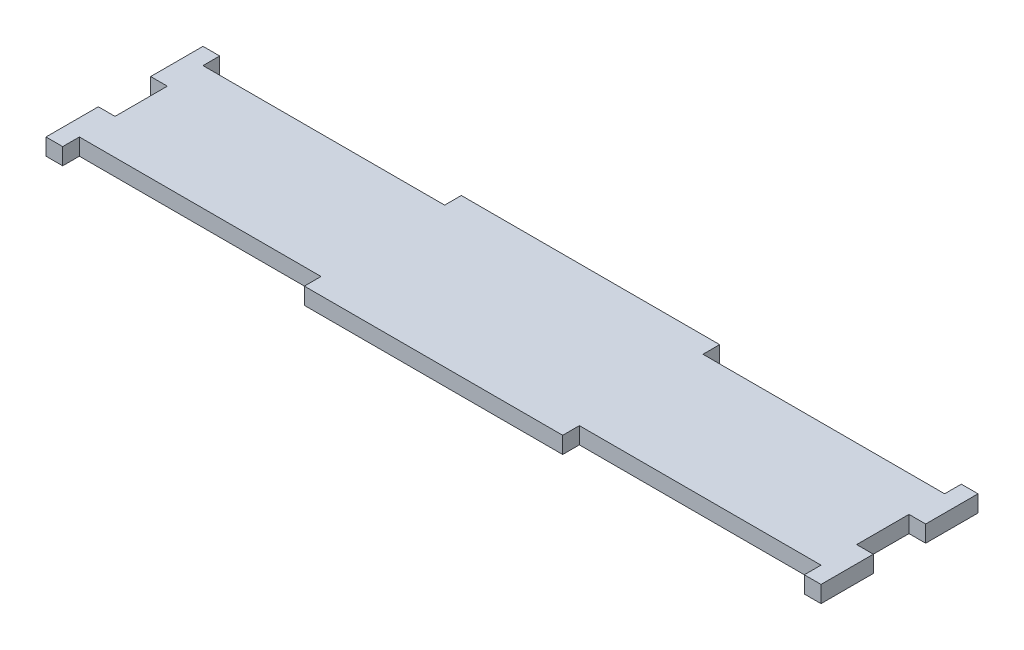
ISO-10303-21;
HEADER;
FILE_DESCRIPTION(('STEP AP214'),'2;1');
FILE_NAME('part.step','',(''),(''),'','','');
FILE_SCHEMA(('AUTOMOTIVE_DESIGN { 1 0 10303 214 1 1 1 1 }'));
ENDSEC;
DATA;
#1=APPLICATION_CONTEXT('core data for automotive mechanical design processes');
#2=APPLICATION_PROTOCOL_DEFINITION('international standard','automotive_design',2000,#1);
#3=PRODUCT_CONTEXT('',#1,'mechanical');
#4=PRODUCT('Part','Part','',(#3));
#5=PRODUCT_RELATED_PRODUCT_CATEGORY('part','',(#4));
#6=PRODUCT_DEFINITION_FORMATION('','',#4);
#7=PRODUCT_DEFINITION_CONTEXT('part definition',#1,'design');
#8=PRODUCT_DEFINITION('design','',#6,#7);
#9=PRODUCT_DEFINITION_SHAPE('','',#8);
#10=(LENGTH_UNIT() NAMED_UNIT(*) SI_UNIT(.MILLI.,.METRE.));
#11=(NAMED_UNIT(*) PLANE_ANGLE_UNIT() SI_UNIT($,.RADIAN.));
#12=(NAMED_UNIT(*) SI_UNIT($,.STERADIAN.) SOLID_ANGLE_UNIT());
#13=UNCERTAINTY_MEASURE_WITH_UNIT(LENGTH_MEASURE(1.E-05),#10,'distance_accuracy_value','');
#14=(GEOMETRIC_REPRESENTATION_CONTEXT(3) GLOBAL_UNCERTAINTY_ASSIGNED_CONTEXT((#13)) GLOBAL_UNIT_ASSIGNED_CONTEXT((#10,
#11,#12)) REPRESENTATION_CONTEXT('',''));
#15=CARTESIAN_POINT('',(0.,0.,0.));
#16=DIRECTION('',(0.,0.,1.));
#17=DIRECTION('',(1.,0.,0.));
#18=AXIS2_PLACEMENT_3D('',#15,#16,#17);
#19=CARTESIAN_POINT('',(20.9000000000001,2.7,10.));
#20=DIRECTION('',(0.,0.,-1.));
#21=DIRECTION('',(-1.,0.,0.));
#22=AXIS2_PLACEMENT_3D('',#19,#20,#21);
#23=PLANE('',#22);
#24=DIRECTION('',(1.,0.,0.));
#25=VECTOR('',#24,1.);
#26=CARTESIAN_POINT('',(20.9000000000001,0.,10.));
#27=LINE('',#26,#25);
#28=CARTESIAN_POINT('',(20.9000000000001,0.,10.));
#29=VERTEX_POINT('',#28);
#30=CARTESIAN_POINT('',(60.0000000000001,0.,10.));
#31=VERTEX_POINT('',#30);
#32=EDGE_CURVE('E249',#29,#31,#27,.T.);
#33=ORIENTED_EDGE('',*,*,#32,.T.);
#34=DIRECTION('',(0.,-1.,0.));
#35=VECTOR('',#34,1.);
#36=CARTESIAN_POINT('',(60.0000000000001,2.7,10.));
#37=LINE('',#36,#35);
#38=CARTESIAN_POINT('',(60.0000000000001,2.7,10.));
#39=VERTEX_POINT('',#38);
#40=EDGE_CURVE('E11',#39,#31,#37,.T.);
#41=ORIENTED_EDGE('',*,*,#40,.F.);
#42=DIRECTION('',(1.,0.,0.));
#43=VECTOR('',#42,1.);
#44=CARTESIAN_POINT('',(20.9000000000001,2.7,10.));
#45=LINE('',#44,#43);
#46=CARTESIAN_POINT('',(20.9000000000001,2.7,10.));
#47=VERTEX_POINT('',#46);
#48=EDGE_CURVE('E303',#47,#39,#45,.T.);
#49=ORIENTED_EDGE('',*,*,#48,.F.);
#50=DIRECTION('',(0.,-1.,0.));
#51=VECTOR('',#50,1.);
#52=CARTESIAN_POINT('',(20.9000000000001,2.7,10.));
#53=LINE('',#52,#51);
#54=EDGE_CURVE('E245',#47,#29,#53,.T.);
#55=ORIENTED_EDGE('',*,*,#54,.T.);
#56=EDGE_LOOP('',(#33,#41,#49,#55));
#57=FACE_BOUND('',#56,.T.);
#58=ADVANCED_FACE('F33',(#57),#23,.F.);
#59=CARTESIAN_POINT('',(60.0000000000001,2.7,10.));
#60=DIRECTION('',(1.,0.,0.));
#61=DIRECTION('',(0.,0.,-1.));
#62=AXIS2_PLACEMENT_3D('',#59,#60,#61);
#63=PLANE('',#62);
#64=DIRECTION('',(0.,0.,1.));
#65=VECTOR('',#64,1.);
#66=CARTESIAN_POINT('',(60.0000000000001,0.,10.));
#67=LINE('',#66,#65);
#68=CARTESIAN_POINT('',(60.0000000000001,0.,12.7));
#69=VERTEX_POINT('',#68);
#70=EDGE_CURVE('E252',#31,#69,#67,.T.);
#71=ORIENTED_EDGE('',*,*,#70,.T.);
#72=DIRECTION('',(0.,-1.,0.));
#73=VECTOR('',#72,1.);
#74=CARTESIAN_POINT('',(60.0000000000001,2.7,12.7));
#75=LINE('',#74,#73);
#76=CARTESIAN_POINT('',(60.0000000000001,2.7,12.7));
#77=VERTEX_POINT('',#76);
#78=EDGE_CURVE('E41',#77,#69,#75,.T.);
#79=ORIENTED_EDGE('',*,*,#78,.F.);
#80=DIRECTION('',(0.,0.,1.));
#81=VECTOR('',#80,1.);
#82=CARTESIAN_POINT('',(60.0000000000001,2.7,10.));
#83=LINE('',#82,#81);
#84=EDGE_CURVE('E152',#39,#77,#83,.T.);
#85=ORIENTED_EDGE('',*,*,#84,.F.);
#86=ORIENTED_EDGE('',*,*,#40,.T.);
#87=EDGE_LOOP('',(#71,#79,#85,#86));
#88=FACE_BOUND('',#87,.T.);
#89=ADVANCED_FACE('F461',(#88),#63,.F.);
#90=CARTESIAN_POINT('',(60.0000000000001,2.7,12.7));
#91=DIRECTION('',(0.,0.,-1.));
#92=DIRECTION('',(-1.,0.,0.));
#93=AXIS2_PLACEMENT_3D('',#90,#91,#92);
#94=PLANE('',#93);
#95=DIRECTION('',(1.,0.,0.));
#96=VECTOR('',#95,1.);
#97=CARTESIAN_POINT('',(60.0000000000001,0.,12.7));
#98=LINE('',#97,#96);
#99=CARTESIAN_POINT('',(62.7000000000001,0.,12.7));
#100=VERTEX_POINT('',#99);
#101=EDGE_CURVE('E254',#69,#100,#98,.T.);
#102=ORIENTED_EDGE('',*,*,#101,.T.);
#103=DIRECTION('',(0.,-1.,0.));
#104=VECTOR('',#103,1.);
#105=CARTESIAN_POINT('',(62.7000000000001,2.7,12.7));
#106=LINE('',#105,#104);
#107=CARTESIAN_POINT('',(62.7000000000001,2.7,12.7));
#108=VERTEX_POINT('',#107);
#109=EDGE_CURVE('E370',#108,#100,#106,.T.);
#110=ORIENTED_EDGE('',*,*,#109,.F.);
#111=DIRECTION('',(1.,0.,0.));
#112=VECTOR('',#111,1.);
#113=CARTESIAN_POINT('',(60.0000000000001,2.7,12.7));
#114=LINE('',#113,#112);
#115=EDGE_CURVE('E378',#77,#108,#114,.T.);
#116=ORIENTED_EDGE('',*,*,#115,.F.);
#117=ORIENTED_EDGE('',*,*,#78,.T.);
#118=EDGE_LOOP('',(#102,#110,#116,#117));
#119=FACE_BOUND('',#118,.T.);
#120=ADVANCED_FACE('F376',(#119),#94,.F.);
#121=CARTESIAN_POINT('',(62.7000000000001,2.7,4.23333333333333));
#122=DIRECTION('',(-1.,0.,0.));
#123=DIRECTION('',(0.,0.,1.));
#124=AXIS2_PLACEMENT_3D('',#121,#122,#123);
#125=PLANE('',#124);
#126=DIRECTION('',(0.,0.,-1.));
#127=VECTOR('',#126,1.);
#128=CARTESIAN_POINT('',(62.7000000000001,0.,4.23333333333333));
#129=LINE('',#128,#127);
#130=CARTESIAN_POINT('',(62.7000000000001,0.,4.23333333333333));
#131=VERTEX_POINT('',#130);
#132=EDGE_CURVE('E256',#100,#131,#129,.T.);
#133=ORIENTED_EDGE('',*,*,#132,.T.);
#134=DIRECTION('',(0.,-1.,0.));
#135=VECTOR('',#134,1.);
#136=CARTESIAN_POINT('',(62.7000000000001,2.7,4.23333333333333));
#137=LINE('',#136,#135);
#138=CARTESIAN_POINT('',(62.7000000000001,2.7,4.23333333333333));
#139=VERTEX_POINT('',#138);
#140=EDGE_CURVE('E367',#139,#131,#137,.T.);
#141=ORIENTED_EDGE('',*,*,#140,.F.);
#142=DIRECTION('',(0.,0.,-1.));
#143=VECTOR('',#142,1.);
#144=CARTESIAN_POINT('',(62.7000000000001,2.7,4.23333333333333));
#145=LINE('',#144,#143);
#146=EDGE_CURVE('E396',#108,#139,#145,.T.);
#147=ORIENTED_EDGE('',*,*,#146,.F.);
#148=ORIENTED_EDGE('',*,*,#109,.T.);
#149=EDGE_LOOP('',(#133,#141,#147,#148));
#150=FACE_BOUND('',#149,.T.);
#151=ADVANCED_FACE('F387',(#150),#125,.F.);
#152=CARTESIAN_POINT('',(62.7000000000001,2.7,4.23333333333333));
#153=DIRECTION('',(0.,0.,1.));
#154=DIRECTION('',(1.,0.,0.));
#155=AXIS2_PLACEMENT_3D('',#152,#153,#154);
#156=PLANE('',#155);
#157=DIRECTION('',(-1.,0.,0.));
#158=VECTOR('',#157,1.);
#159=CARTESIAN_POINT('',(62.7000000000001,0.,4.23333333333333));
#160=LINE('',#159,#158);
#161=CARTESIAN_POINT('',(60.0000000000001,0.,4.23333333333333));
#162=VERTEX_POINT('',#161);
#163=EDGE_CURVE('E258',#131,#162,#160,.T.);
#164=ORIENTED_EDGE('',*,*,#163,.T.);
#165=DIRECTION('',(0.,-1.,0.));
#166=VECTOR('',#165,1.);
#167=CARTESIAN_POINT('',(60.0000000000001,2.7,4.23333333333333));
#168=LINE('',#167,#166);
#169=CARTESIAN_POINT('',(60.0000000000001,2.7,4.23333333333333));
#170=VERTEX_POINT('',#169);
#171=EDGE_CURVE('E364',#170,#162,#168,.T.);
#172=ORIENTED_EDGE('',*,*,#171,.F.);
#173=DIRECTION('',(-1.,0.,0.));
#174=VECTOR('',#173,1.);
#175=CARTESIAN_POINT('',(62.7000000000001,2.7,4.23333333333333));
#176=LINE('',#175,#174);
#177=EDGE_CURVE('E393',#139,#170,#176,.T.);
#178=ORIENTED_EDGE('',*,*,#177,.F.);
#179=ORIENTED_EDGE('',*,*,#140,.T.);
#180=EDGE_LOOP('',(#164,#172,#178,#179));
#181=FACE_BOUND('',#180,.T.);
#182=ADVANCED_FACE('F391',(#181),#156,.F.);
#183=CARTESIAN_POINT('',(60.0000000000001,2.7,-4.23333333333333));
#184=DIRECTION('',(-1.,0.,0.));
#185=DIRECTION('',(0.,0.,1.));
#186=AXIS2_PLACEMENT_3D('',#183,#184,#185);
#187=PLANE('',#186);
#188=DIRECTION('',(0.,0.,-1.));
#189=VECTOR('',#188,1.);
#190=CARTESIAN_POINT('',(60.0000000000001,0.,-4.23333333333333));
#191=LINE('',#190,#189);
#192=CARTESIAN_POINT('',(60.0000000000001,0.,-4.23333333333333));
#193=VERTEX_POINT('',#192);
#194=EDGE_CURVE('E260',#162,#193,#191,.T.);
#195=ORIENTED_EDGE('',*,*,#194,.T.);
#196=DIRECTION('',(0.,-1.,0.));
#197=VECTOR('',#196,1.);
#198=CARTESIAN_POINT('',(60.0000000000001,2.7,-4.23333333333333));
#199=LINE('',#198,#197);
#200=CARTESIAN_POINT('',(60.0000000000001,2.7,-4.23333333333333));
#201=VERTEX_POINT('',#200);
#202=EDGE_CURVE('E361',#201,#193,#199,.T.);
#203=ORIENTED_EDGE('',*,*,#202,.F.);
#204=DIRECTION('',(0.,0.,-1.));
#205=VECTOR('',#204,1.);
#206=CARTESIAN_POINT('',(60.0000000000001,2.7,-4.23333333333333));
#207=LINE('',#206,#205);
#208=EDGE_CURVE('E395',#170,#201,#207,.T.);
#209=ORIENTED_EDGE('',*,*,#208,.F.);
#210=ORIENTED_EDGE('',*,*,#171,.T.);
#211=EDGE_LOOP('',(#195,#203,#209,#210));
#212=FACE_BOUND('',#211,.T.);
#213=ADVANCED_FACE('F474',(#212),#187,.F.);
#214=CARTESIAN_POINT('',(62.7000000000001,2.7,-4.23333333333333));
#215=DIRECTION('',(0.,0.,-1.));
#216=DIRECTION('',(-1.,0.,0.));
#217=AXIS2_PLACEMENT_3D('',#214,#215,#216);
#218=PLANE('',#217);
#219=DIRECTION('',(1.,0.,0.));
#220=VECTOR('',#219,1.);
#221=CARTESIAN_POINT('',(62.7000000000001,0.,-4.23333333333333));
#222=LINE('',#221,#220);
#223=CARTESIAN_POINT('',(62.7000000000001,0.,-4.23333333333333));
#224=VERTEX_POINT('',#223);
#225=EDGE_CURVE('E262',#193,#224,#222,.T.);
#226=ORIENTED_EDGE('',*,*,#225,.T.);
#227=DIRECTION('',(0.,-1.,0.));
#228=VECTOR('',#227,1.);
#229=CARTESIAN_POINT('',(62.7000000000001,2.7,-4.23333333333333));
#230=LINE('',#229,#228);
#231=CARTESIAN_POINT('',(62.7000000000001,2.7,-4.23333333333333));
#232=VERTEX_POINT('',#231);
#233=EDGE_CURVE('E358',#232,#224,#230,.T.);
#234=ORIENTED_EDGE('',*,*,#233,.F.);
#235=DIRECTION('',(1.,0.,0.));
#236=VECTOR('',#235,1.);
#237=CARTESIAN_POINT('',(62.7000000000001,2.7,-4.23333333333333));
#238=LINE('',#237,#236);
#239=EDGE_CURVE('E398',#201,#232,#238,.T.);
#240=ORIENTED_EDGE('',*,*,#239,.F.);
#241=ORIENTED_EDGE('',*,*,#202,.T.);
#242=EDGE_LOOP('',(#226,#234,#240,#241));
#243=FACE_BOUND('',#242,.T.);
#244=ADVANCED_FACE('F477',(#243),#218,.F.);
#245=CARTESIAN_POINT('',(62.7000000000001,2.7,-12.7));
#246=DIRECTION('',(-1.,0.,0.));
#247=DIRECTION('',(0.,0.,1.));
#248=AXIS2_PLACEMENT_3D('',#245,#246,#247);
#249=PLANE('',#248);
#250=DIRECTION('',(0.,0.,-1.));
#251=VECTOR('',#250,1.);
#252=CARTESIAN_POINT('',(62.7000000000001,0.,-12.7));
#253=LINE('',#252,#251);
#254=CARTESIAN_POINT('',(62.7000000000001,0.,-12.7));
#255=VERTEX_POINT('',#254);
#256=EDGE_CURVE('E264',#224,#255,#253,.T.);
#257=ORIENTED_EDGE('',*,*,#256,.T.);
#258=DIRECTION('',(0.,-1.,0.));
#259=VECTOR('',#258,1.);
#260=CARTESIAN_POINT('',(62.7000000000001,2.7,-12.7));
#261=LINE('',#260,#259);
#262=CARTESIAN_POINT('',(62.7000000000001,2.7,-12.7));
#263=VERTEX_POINT('',#262);
#264=EDGE_CURVE('E355',#263,#255,#261,.T.);
#265=ORIENTED_EDGE('',*,*,#264,.F.);
#266=DIRECTION('',(0.,0.,-1.));
#267=VECTOR('',#266,1.);
#268=CARTESIAN_POINT('',(62.7000000000001,2.7,-12.7));
#269=LINE('',#268,#267);
#270=EDGE_CURVE('E404',#232,#263,#269,.T.);
#271=ORIENTED_EDGE('',*,*,#270,.F.);
#272=ORIENTED_EDGE('',*,*,#233,.T.);
#273=EDGE_LOOP('',(#257,#265,#271,#272));
#274=FACE_BOUND('',#273,.T.);
#275=ADVANCED_FACE('F481',(#274),#249,.F.);
#276=CARTESIAN_POINT('',(60.0000000000001,2.7,-12.7));
#277=DIRECTION('',(0.,0.,1.));
#278=DIRECTION('',(1.,0.,0.));
#279=AXIS2_PLACEMENT_3D('',#276,#277,#278);
#280=PLANE('',#279);
#281=DIRECTION('',(-1.,0.,0.));
#282=VECTOR('',#281,1.);
#283=CARTESIAN_POINT('',(60.0000000000001,0.,-12.7));
#284=LINE('',#283,#282);
#285=CARTESIAN_POINT('',(60.0000000000001,0.,-12.7));
#286=VERTEX_POINT('',#285);
#287=EDGE_CURVE('E266',#255,#286,#284,.T.);
#288=ORIENTED_EDGE('',*,*,#287,.T.);
#289=DIRECTION('',(0.,-1.,0.));
#290=VECTOR('',#289,1.);
#291=CARTESIAN_POINT('',(60.0000000000001,2.7,-12.7));
#292=LINE('',#291,#290);
#293=CARTESIAN_POINT('',(60.0000000000001,2.7,-12.7));
#294=VERTEX_POINT('',#293);
#295=EDGE_CURVE('E352',#294,#286,#292,.T.);
#296=ORIENTED_EDGE('',*,*,#295,.F.);
#297=DIRECTION('',(-1.,0.,0.));
#298=VECTOR('',#297,1.);
#299=CARTESIAN_POINT('',(60.0000000000001,2.7,-12.7));
#300=LINE('',#299,#298);
#301=EDGE_CURVE('E406',#263,#294,#300,.T.);
#302=ORIENTED_EDGE('',*,*,#301,.F.);
#303=ORIENTED_EDGE('',*,*,#264,.T.);
#304=EDGE_LOOP('',(#288,#296,#302,#303));
#305=FACE_BOUND('',#304,.T.);
#306=ADVANCED_FACE('F485',(#305),#280,.F.);
#307=CARTESIAN_POINT('',(60.0000000000001,2.7,-10.));
#308=DIRECTION('',(1.,0.,0.));
#309=DIRECTION('',(0.,0.,-1.));
#310=AXIS2_PLACEMENT_3D('',#307,#308,#309);
#311=PLANE('',#310);
#312=DIRECTION('',(0.,0.,1.));
#313=VECTOR('',#312,1.);
#314=CARTESIAN_POINT('',(60.0000000000001,0.,-10.));
#315=LINE('',#314,#313);
#316=CARTESIAN_POINT('',(60.0000000000001,0.,-10.));
#317=VERTEX_POINT('',#316);
#318=EDGE_CURVE('E268',#286,#317,#315,.T.);
#319=ORIENTED_EDGE('',*,*,#318,.T.);
#320=DIRECTION('',(0.,-1.,0.));
#321=VECTOR('',#320,1.);
#322=CARTESIAN_POINT('',(60.0000000000001,2.7,-10.));
#323=LINE('',#322,#321);
#324=CARTESIAN_POINT('',(60.0000000000001,2.7,-10.));
#325=VERTEX_POINT('',#324);
#326=EDGE_CURVE('E349',#325,#317,#323,.T.);
#327=ORIENTED_EDGE('',*,*,#326,.F.);
#328=DIRECTION('',(0.,0.,1.));
#329=VECTOR('',#328,1.);
#330=CARTESIAN_POINT('',(60.0000000000001,2.7,-10.));
#331=LINE('',#330,#329);
#332=EDGE_CURVE('E408',#294,#325,#331,.T.);
#333=ORIENTED_EDGE('',*,*,#332,.F.);
#334=ORIENTED_EDGE('',*,*,#295,.T.);
#335=EDGE_LOOP('',(#319,#327,#333,#334));
#336=FACE_BOUND('',#335,.T.);
#337=ADVANCED_FACE('F489',(#336),#311,.F.);
#338=CARTESIAN_POINT('',(20.9000000000001,2.7,-10.));
#339=DIRECTION('',(0.,0.,1.));
#340=DIRECTION('',(1.,0.,0.));
#341=AXIS2_PLACEMENT_3D('',#338,#339,#340);
#342=PLANE('',#341);
#343=DIRECTION('',(-1.,0.,0.));
#344=VECTOR('',#343,1.);
#345=CARTESIAN_POINT('',(20.9000000000001,0.,-10.));
#346=LINE('',#345,#344);
#347=CARTESIAN_POINT('',(20.9000000000001,0.,-10.));
#348=VERTEX_POINT('',#347);
#349=EDGE_CURVE('E270',#317,#348,#346,.T.);
#350=ORIENTED_EDGE('',*,*,#349,.T.);
#351=DIRECTION('',(0.,-1.,0.));
#352=VECTOR('',#351,1.);
#353=CARTESIAN_POINT('',(20.9000000000001,2.7,-10.));
#354=LINE('',#353,#352);
#355=CARTESIAN_POINT('',(20.9000000000001,2.7,-10.));
#356=VERTEX_POINT('',#355);
#357=EDGE_CURVE('E346',#356,#348,#354,.T.);
#358=ORIENTED_EDGE('',*,*,#357,.F.);
#359=DIRECTION('',(-1.,0.,0.));
#360=VECTOR('',#359,1.);
#361=CARTESIAN_POINT('',(20.9000000000001,2.7,-10.));
#362=LINE('',#361,#360);
#363=EDGE_CURVE('E410',#325,#356,#362,.T.);
#364=ORIENTED_EDGE('',*,*,#363,.F.);
#365=ORIENTED_EDGE('',*,*,#326,.T.);
#366=EDGE_LOOP('',(#350,#358,#364,#365));
#367=FACE_BOUND('',#366,.T.);
#368=ADVANCED_FACE('F493',(#367),#342,.F.);
#369=CARTESIAN_POINT('',(20.9000000000001,2.7,-12.7));
#370=DIRECTION('',(-1.,0.,0.));
#371=DIRECTION('',(0.,0.,1.));
#372=AXIS2_PLACEMENT_3D('',#369,#370,#371);
#373=PLANE('',#372);
#374=DIRECTION('',(0.,0.,-1.));
#375=VECTOR('',#374,1.);
#376=CARTESIAN_POINT('',(20.9000000000001,0.,-12.7));
#377=LINE('',#376,#375);
#378=CARTESIAN_POINT('',(20.9000000000001,0.,-12.7));
#379=VERTEX_POINT('',#378);
#380=EDGE_CURVE('E272',#348,#379,#377,.T.);
#381=ORIENTED_EDGE('',*,*,#380,.T.);
#382=DIRECTION('',(0.,-1.,0.));
#383=VECTOR('',#382,1.);
#384=CARTESIAN_POINT('',(20.9000000000001,2.7,-12.7));
#385=LINE('',#384,#383);
#386=CARTESIAN_POINT('',(20.9000000000001,2.7,-12.7));
#387=VERTEX_POINT('',#386);
#388=EDGE_CURVE('E343',#387,#379,#385,.T.);
#389=ORIENTED_EDGE('',*,*,#388,.F.);
#390=DIRECTION('',(0.,0.,-1.));
#391=VECTOR('',#390,1.);
#392=CARTESIAN_POINT('',(20.9000000000001,2.7,-12.7));
#393=LINE('',#392,#391);
#394=EDGE_CURVE('E412',#356,#387,#393,.T.);
#395=ORIENTED_EDGE('',*,*,#394,.F.);
#396=ORIENTED_EDGE('',*,*,#357,.T.);
#397=EDGE_LOOP('',(#381,#389,#395,#396));
#398=FACE_BOUND('',#397,.T.);
#399=ADVANCED_FACE('F497',(#398),#373,.F.);
#400=CARTESIAN_POINT('',(-20.8999999999999,2.7,-12.7));
#401=DIRECTION('',(0.,0.,1.));
#402=DIRECTION('',(1.,0.,0.));
#403=AXIS2_PLACEMENT_3D('',#400,#401,#402);
#404=PLANE('',#403);
#405=DIRECTION('',(-1.,0.,0.));
#406=VECTOR('',#405,1.);
#407=CARTESIAN_POINT('',(-20.8999999999999,0.,-12.7));
#408=LINE('',#407,#406);
#409=CARTESIAN_POINT('',(-20.8999999999999,0.,-12.7));
#410=VERTEX_POINT('',#409);
#411=EDGE_CURVE('E274',#379,#410,#408,.T.);
#412=ORIENTED_EDGE('',*,*,#411,.T.);
#413=DIRECTION('',(0.,-1.,0.));
#414=VECTOR('',#413,1.);
#415=CARTESIAN_POINT('',(-20.8999999999999,2.7,-12.7));
#416=LINE('',#415,#414);
#417=CARTESIAN_POINT('',(-20.8999999999999,2.7,-12.7));
#418=VERTEX_POINT('',#417);
#419=EDGE_CURVE('E340',#418,#410,#416,.T.);
#420=ORIENTED_EDGE('',*,*,#419,.F.);
#421=DIRECTION('',(-1.,0.,0.));
#422=VECTOR('',#421,1.);
#423=CARTESIAN_POINT('',(-20.8999999999999,2.7,-12.7));
#424=LINE('',#423,#422);
#425=EDGE_CURVE('E414',#387,#418,#424,.T.);
#426=ORIENTED_EDGE('',*,*,#425,.F.);
#427=ORIENTED_EDGE('',*,*,#388,.T.);
#428=EDGE_LOOP('',(#412,#420,#426,#427));
#429=FACE_BOUND('',#428,.T.);
#430=ADVANCED_FACE('F501',(#429),#404,.F.);
#431=CARTESIAN_POINT('',(-20.8999999999999,2.7,-12.7));
#432=DIRECTION('',(1.,0.,0.));
#433=DIRECTION('',(0.,0.,-1.));
#434=AXIS2_PLACEMENT_3D('',#431,#432,#433);
#435=PLANE('',#434);
#436=DIRECTION('',(0.,0.,1.));
#437=VECTOR('',#436,1.);
#438=CARTESIAN_POINT('',(-20.8999999999999,0.,-12.7));
#439=LINE('',#438,#437);
#440=CARTESIAN_POINT('',(-20.8999999999999,0.,-10.));
#441=VERTEX_POINT('',#440);
#442=EDGE_CURVE('E276',#410,#441,#439,.T.);
#443=ORIENTED_EDGE('',*,*,#442,.T.);
#444=DIRECTION('',(0.,-1.,0.));
#445=VECTOR('',#444,1.);
#446=CARTESIAN_POINT('',(-20.8999999999999,2.7,-10.));
#447=LINE('',#446,#445);
#448=CARTESIAN_POINT('',(-20.8999999999999,2.7,-10.));
#449=VERTEX_POINT('',#448);
#450=EDGE_CURVE('E337',#449,#441,#447,.T.);
#451=ORIENTED_EDGE('',*,*,#450,.F.);
#452=DIRECTION('',(0.,0.,1.));
#453=VECTOR('',#452,1.);
#454=CARTESIAN_POINT('',(-20.8999999999999,2.7,-12.7));
#455=LINE('',#454,#453);
#456=EDGE_CURVE('E416',#418,#449,#455,.T.);
#457=ORIENTED_EDGE('',*,*,#456,.F.);
#458=ORIENTED_EDGE('',*,*,#419,.T.);
#459=EDGE_LOOP('',(#443,#451,#457,#458));
#460=FACE_BOUND('',#459,.T.);
#461=ADVANCED_FACE('F505',(#460),#435,.F.);
#462=CARTESIAN_POINT('',(-59.9999999999999,2.7,-10.));
#463=DIRECTION('',(0.,0.,1.));
#464=DIRECTION('',(1.,0.,0.));
#465=AXIS2_PLACEMENT_3D('',#462,#463,#464);
#466=PLANE('',#465);
#467=DIRECTION('',(-1.,0.,0.));
#468=VECTOR('',#467,1.);
#469=CARTESIAN_POINT('',(-59.9999999999999,0.,-10.));
#470=LINE('',#469,#468);
#471=CARTESIAN_POINT('',(-59.9999999999999,0.,-10.));
#472=VERTEX_POINT('',#471);
#473=EDGE_CURVE('E278',#441,#472,#470,.T.);
#474=ORIENTED_EDGE('',*,*,#473,.T.);
#475=DIRECTION('',(0.,-1.,0.));
#476=VECTOR('',#475,1.);
#477=CARTESIAN_POINT('',(-59.9999999999999,2.7,-10.));
#478=LINE('',#477,#476);
#479=CARTESIAN_POINT('',(-59.9999999999999,2.7,-10.));
#480=VERTEX_POINT('',#479);
#481=EDGE_CURVE('E334',#480,#472,#478,.T.);
#482=ORIENTED_EDGE('',*,*,#481,.F.);
#483=DIRECTION('',(-1.,0.,0.));
#484=VECTOR('',#483,1.);
#485=CARTESIAN_POINT('',(-59.9999999999999,2.7,-10.));
#486=LINE('',#485,#484);
#487=EDGE_CURVE('E418',#449,#480,#486,.T.);
#488=ORIENTED_EDGE('',*,*,#487,.F.);
#489=ORIENTED_EDGE('',*,*,#450,.T.);
#490=EDGE_LOOP('',(#474,#482,#488,#489));
#491=FACE_BOUND('',#490,.T.);
#492=ADVANCED_FACE('F509',(#491),#466,.F.);
#493=CARTESIAN_POINT('',(-59.9999999999999,2.7,-10.));
#494=DIRECTION('',(-1.,0.,0.));
#495=DIRECTION('',(0.,0.,1.));
#496=AXIS2_PLACEMENT_3D('',#493,#494,#495);
#497=PLANE('',#496);
#498=DIRECTION('',(0.,0.,-1.));
#499=VECTOR('',#498,1.);
#500=CARTESIAN_POINT('',(-59.9999999999999,0.,-10.));
#501=LINE('',#500,#499);
#502=CARTESIAN_POINT('',(-59.9999999999999,0.,-12.7));
#503=VERTEX_POINT('',#502);
#504=EDGE_CURVE('E280',#472,#503,#501,.T.);
#505=ORIENTED_EDGE('',*,*,#504,.T.);
#506=DIRECTION('',(0.,-1.,0.));
#507=VECTOR('',#506,1.);
#508=CARTESIAN_POINT('',(-59.9999999999999,2.7,-12.7));
#509=LINE('',#508,#507);
#510=CARTESIAN_POINT('',(-59.9999999999999,2.7,-12.7));
#511=VERTEX_POINT('',#510);
#512=EDGE_CURVE('E331',#511,#503,#509,.T.);
#513=ORIENTED_EDGE('',*,*,#512,.F.);
#514=DIRECTION('',(0.,0.,-1.));
#515=VECTOR('',#514,1.);
#516=CARTESIAN_POINT('',(-59.9999999999999,2.7,-10.));
#517=LINE('',#516,#515);
#518=EDGE_CURVE('E420',#480,#511,#517,.T.);
#519=ORIENTED_EDGE('',*,*,#518,.F.);
#520=ORIENTED_EDGE('',*,*,#481,.T.);
#521=EDGE_LOOP('',(#505,#513,#519,#520));
#522=FACE_BOUND('',#521,.T.);
#523=ADVANCED_FACE('F513',(#522),#497,.F.);
#524=CARTESIAN_POINT('',(-62.6999999999999,2.7,-12.7));
#525=DIRECTION('',(0.,0.,1.));
#526=DIRECTION('',(1.,0.,0.));
#527=AXIS2_PLACEMENT_3D('',#524,#525,#526);
#528=PLANE('',#527);
#529=DIRECTION('',(-1.,0.,0.));
#530=VECTOR('',#529,1.);
#531=CARTESIAN_POINT('',(-62.6999999999999,0.,-12.7));
#532=LINE('',#531,#530);
#533=CARTESIAN_POINT('',(-62.6999999999999,0.,-12.7));
#534=VERTEX_POINT('',#533);
#535=EDGE_CURVE('E282',#503,#534,#532,.T.);
#536=ORIENTED_EDGE('',*,*,#535,.T.);
#537=DIRECTION('',(0.,-1.,0.));
#538=VECTOR('',#537,1.);
#539=CARTESIAN_POINT('',(-62.6999999999999,2.7,-12.7));
#540=LINE('',#539,#538);
#541=CARTESIAN_POINT('',(-62.6999999999999,2.7,-12.7));
#542=VERTEX_POINT('',#541);
#543=EDGE_CURVE('E328',#542,#534,#540,.T.);
#544=ORIENTED_EDGE('',*,*,#543,.F.);
#545=DIRECTION('',(-1.,0.,0.));
#546=VECTOR('',#545,1.);
#547=CARTESIAN_POINT('',(-62.6999999999999,2.7,-12.7));
#548=LINE('',#547,#546);
#549=EDGE_CURVE('E422',#511,#542,#548,.T.);
#550=ORIENTED_EDGE('',*,*,#549,.F.);
#551=ORIENTED_EDGE('',*,*,#512,.T.);
#552=EDGE_LOOP('',(#536,#544,#550,#551));
#553=FACE_BOUND('',#552,.T.);
#554=ADVANCED_FACE('F517',(#553),#528,.F.);
#555=CARTESIAN_POINT('',(-62.6999999999999,2.7,-12.7));
#556=DIRECTION('',(1.,0.,0.));
#557=DIRECTION('',(0.,0.,-1.));
#558=AXIS2_PLACEMENT_3D('',#555,#556,#557);
#559=PLANE('',#558);
#560=DIRECTION('',(0.,0.,1.));
#561=VECTOR('',#560,1.);
#562=CARTESIAN_POINT('',(-62.6999999999999,0.,-12.7));
#563=LINE('',#562,#561);
#564=CARTESIAN_POINT('',(-62.6999999999999,0.,-4.23333333333333));
#565=VERTEX_POINT('',#564);
#566=EDGE_CURVE('E284',#534,#565,#563,.T.);
#567=ORIENTED_EDGE('',*,*,#566,.T.);
#568=DIRECTION('',(0.,-1.,0.));
#569=VECTOR('',#568,1.);
#570=CARTESIAN_POINT('',(-62.6999999999999,2.7,-4.23333333333333));
#571=LINE('',#570,#569);
#572=CARTESIAN_POINT('',(-62.6999999999999,2.7,-4.23333333333333));
#573=VERTEX_POINT('',#572);
#574=EDGE_CURVE('E325',#573,#565,#571,.T.);
#575=ORIENTED_EDGE('',*,*,#574,.F.);
#576=DIRECTION('',(0.,0.,1.));
#577=VECTOR('',#576,1.);
#578=CARTESIAN_POINT('',(-62.6999999999999,2.7,-12.7));
#579=LINE('',#578,#577);
#580=EDGE_CURVE('E424',#542,#573,#579,.T.);
#581=ORIENTED_EDGE('',*,*,#580,.F.);
#582=ORIENTED_EDGE('',*,*,#543,.T.);
#583=EDGE_LOOP('',(#567,#575,#581,#582));
#584=FACE_BOUND('',#583,.T.);
#585=ADVANCED_FACE('F521',(#584),#559,.F.);
#586=CARTESIAN_POINT('',(-62.6999999999999,2.7,-4.23333333333333));
#587=DIRECTION('',(0.,0.,-1.));
#588=DIRECTION('',(-1.,0.,0.));
#589=AXIS2_PLACEMENT_3D('',#586,#587,#588);
#590=PLANE('',#589);
#591=DIRECTION('',(1.,0.,0.));
#592=VECTOR('',#591,1.);
#593=CARTESIAN_POINT('',(-62.6999999999999,0.,-4.23333333333333));
#594=LINE('',#593,#592);
#595=CARTESIAN_POINT('',(-59.9999999999999,0.,-4.23333333333333));
#596=VERTEX_POINT('',#595);
#597=EDGE_CURVE('E286',#565,#596,#594,.T.);
#598=ORIENTED_EDGE('',*,*,#597,.T.);
#599=DIRECTION('',(0.,-1.,0.));
#600=VECTOR('',#599,1.);
#601=CARTESIAN_POINT('',(-59.9999999999999,2.7,-4.23333333333333));
#602=LINE('',#601,#600);
#603=CARTESIAN_POINT('',(-59.9999999999999,2.7,-4.23333333333333));
#604=VERTEX_POINT('',#603);
#605=EDGE_CURVE('E322',#604,#596,#602,.T.);
#606=ORIENTED_EDGE('',*,*,#605,.F.);
#607=DIRECTION('',(1.,0.,0.));
#608=VECTOR('',#607,1.);
#609=CARTESIAN_POINT('',(-62.6999999999999,2.7,-4.23333333333333));
#610=LINE('',#609,#608);
#611=EDGE_CURVE('E426',#573,#604,#610,.T.);
#612=ORIENTED_EDGE('',*,*,#611,.F.);
#613=ORIENTED_EDGE('',*,*,#574,.T.);
#614=EDGE_LOOP('',(#598,#606,#612,#613));
#615=FACE_BOUND('',#614,.T.);
#616=ADVANCED_FACE('F525',(#615),#590,.F.);
#617=CARTESIAN_POINT('',(-59.9999999999999,2.7,-4.23333333333333));
#618=DIRECTION('',(1.,0.,0.));
#619=DIRECTION('',(0.,0.,-1.));
#620=AXIS2_PLACEMENT_3D('',#617,#618,#619);
#621=PLANE('',#620);
#622=DIRECTION('',(0.,0.,1.));
#623=VECTOR('',#622,1.);
#624=CARTESIAN_POINT('',(-59.9999999999999,0.,-4.23333333333333));
#625=LINE('',#624,#623);
#626=CARTESIAN_POINT('',(-59.9999999999999,0.,4.23333333333333));
#627=VERTEX_POINT('',#626);
#628=EDGE_CURVE('E288',#596,#627,#625,.T.);
#629=ORIENTED_EDGE('',*,*,#628,.T.);
#630=DIRECTION('',(0.,-1.,0.));
#631=VECTOR('',#630,1.);
#632=CARTESIAN_POINT('',(-59.9999999999999,2.7,4.23333333333333));
#633=LINE('',#632,#631);
#634=CARTESIAN_POINT('',(-59.9999999999999,2.7,4.23333333333333));
#635=VERTEX_POINT('',#634);
#636=EDGE_CURVE('E319',#635,#627,#633,.T.);
#637=ORIENTED_EDGE('',*,*,#636,.F.);
#638=DIRECTION('',(0.,0.,1.));
#639=VECTOR('',#638,1.);
#640=CARTESIAN_POINT('',(-59.9999999999999,2.7,-4.23333333333333));
#641=LINE('',#640,#639);
#642=EDGE_CURVE('E428',#604,#635,#641,.T.);
#643=ORIENTED_EDGE('',*,*,#642,.F.);
#644=ORIENTED_EDGE('',*,*,#605,.T.);
#645=EDGE_LOOP('',(#629,#637,#643,#644));
#646=FACE_BOUND('',#645,.T.);
#647=ADVANCED_FACE('F529',(#646),#621,.F.);
#648=CARTESIAN_POINT('',(-62.6999999999999,2.7,4.23333333333333));
#649=DIRECTION('',(0.,0.,1.));
#650=DIRECTION('',(1.,0.,0.));
#651=AXIS2_PLACEMENT_3D('',#648,#649,#650);
#652=PLANE('',#651);
#653=DIRECTION('',(-1.,0.,0.));
#654=VECTOR('',#653,1.);
#655=CARTESIAN_POINT('',(-62.6999999999999,0.,4.23333333333333));
#656=LINE('',#655,#654);
#657=CARTESIAN_POINT('',(-62.6999999999999,0.,4.23333333333333));
#658=VERTEX_POINT('',#657);
#659=EDGE_CURVE('E290',#627,#658,#656,.T.);
#660=ORIENTED_EDGE('',*,*,#659,.T.);
#661=DIRECTION('',(0.,-1.,0.));
#662=VECTOR('',#661,1.);
#663=CARTESIAN_POINT('',(-62.6999999999999,2.7,4.23333333333333));
#664=LINE('',#663,#662);
#665=CARTESIAN_POINT('',(-62.6999999999999,2.7,4.23333333333333));
#666=VERTEX_POINT('',#665);
#667=EDGE_CURVE('E316',#666,#658,#664,.T.);
#668=ORIENTED_EDGE('',*,*,#667,.F.);
#669=DIRECTION('',(-1.,0.,0.));
#670=VECTOR('',#669,1.);
#671=CARTESIAN_POINT('',(-62.6999999999999,2.7,4.23333333333333));
#672=LINE('',#671,#670);
#673=EDGE_CURVE('E430',#635,#666,#672,.T.);
#674=ORIENTED_EDGE('',*,*,#673,.F.);
#675=ORIENTED_EDGE('',*,*,#636,.T.);
#676=EDGE_LOOP('',(#660,#668,#674,#675));
#677=FACE_BOUND('',#676,.T.);
#678=ADVANCED_FACE('F533',(#677),#652,.F.);
#679=CARTESIAN_POINT('',(-62.6999999999999,2.7,4.23333333333333));
#680=DIRECTION('',(1.,0.,0.));
#681=DIRECTION('',(0.,0.,-1.));
#682=AXIS2_PLACEMENT_3D('',#679,#680,#681);
#683=PLANE('',#682);
#684=DIRECTION('',(0.,0.,1.));
#685=VECTOR('',#684,1.);
#686=CARTESIAN_POINT('',(-62.6999999999999,0.,4.23333333333333));
#687=LINE('',#686,#685);
#688=CARTESIAN_POINT('',(-62.6999999999999,0.,12.7));
#689=VERTEX_POINT('',#688);
#690=EDGE_CURVE('E292',#658,#689,#687,.T.);
#691=ORIENTED_EDGE('',*,*,#690,.T.);
#692=DIRECTION('',(0.,-1.,0.));
#693=VECTOR('',#692,1.);
#694=CARTESIAN_POINT('',(-62.6999999999999,2.7,12.7));
#695=LINE('',#694,#693);
#696=CARTESIAN_POINT('',(-62.6999999999999,2.7,12.7));
#697=VERTEX_POINT('',#696);
#698=EDGE_CURVE('E313',#697,#689,#695,.T.);
#699=ORIENTED_EDGE('',*,*,#698,.F.);
#700=DIRECTION('',(0.,0.,1.));
#701=VECTOR('',#700,1.);
#702=CARTESIAN_POINT('',(-62.6999999999999,2.7,4.23333333333333));
#703=LINE('',#702,#701);
#704=EDGE_CURVE('E432',#666,#697,#703,.T.);
#705=ORIENTED_EDGE('',*,*,#704,.F.);
#706=ORIENTED_EDGE('',*,*,#667,.T.);
#707=EDGE_LOOP('',(#691,#699,#705,#706));
#708=FACE_BOUND('',#707,.T.);
#709=ADVANCED_FACE('F537',(#708),#683,.F.);
#710=CARTESIAN_POINT('',(-62.6999999999999,2.7,12.7));
#711=DIRECTION('',(0.,0.,-1.));
#712=DIRECTION('',(-1.,0.,0.));
#713=AXIS2_PLACEMENT_3D('',#710,#711,#712);
#714=PLANE('',#713);
#715=DIRECTION('',(1.,0.,0.));
#716=VECTOR('',#715,1.);
#717=CARTESIAN_POINT('',(-62.6999999999999,0.,12.7));
#718=LINE('',#717,#716);
#719=CARTESIAN_POINT('',(-59.9999999999999,0.,12.7));
#720=VERTEX_POINT('',#719);
#721=EDGE_CURVE('E294',#689,#720,#718,.T.);
#722=ORIENTED_EDGE('',*,*,#721,.T.);
#723=DIRECTION('',(0.,-1.,0.));
#724=VECTOR('',#723,1.);
#725=CARTESIAN_POINT('',(-59.9999999999999,2.7,12.7));
#726=LINE('',#725,#724);
#727=CARTESIAN_POINT('',(-59.9999999999999,2.7,12.7));
#728=VERTEX_POINT('',#727);
#729=EDGE_CURVE('E310',#728,#720,#726,.T.);
#730=ORIENTED_EDGE('',*,*,#729,.F.);
#731=DIRECTION('',(1.,0.,0.));
#732=VECTOR('',#731,1.);
#733=CARTESIAN_POINT('',(-62.6999999999999,2.7,12.7));
#734=LINE('',#733,#732);
#735=EDGE_CURVE('E434',#697,#728,#734,.T.);
#736=ORIENTED_EDGE('',*,*,#735,.F.);
#737=ORIENTED_EDGE('',*,*,#698,.T.);
#738=EDGE_LOOP('',(#722,#730,#736,#737));
#739=FACE_BOUND('',#738,.T.);
#740=ADVANCED_FACE('F541',(#739),#714,.F.);
#741=CARTESIAN_POINT('',(-59.9999999999999,2.7,10.));
#742=DIRECTION('',(-1.,0.,0.));
#743=DIRECTION('',(0.,0.,1.));
#744=AXIS2_PLACEMENT_3D('',#741,#742,#743);
#745=PLANE('',#744);
#746=DIRECTION('',(0.,0.,-1.));
#747=VECTOR('',#746,1.);
#748=CARTESIAN_POINT('',(-59.9999999999999,0.,10.));
#749=LINE('',#748,#747);
#750=CARTESIAN_POINT('',(-59.9999999999999,0.,10.));
#751=VERTEX_POINT('',#750);
#752=EDGE_CURVE('E296',#720,#751,#749,.T.);
#753=ORIENTED_EDGE('',*,*,#752,.T.);
#754=DIRECTION('',(0.,-1.,0.));
#755=VECTOR('',#754,1.);
#756=CARTESIAN_POINT('',(-59.9999999999999,2.7,10.));
#757=LINE('',#756,#755);
#758=CARTESIAN_POINT('',(-59.9999999999999,2.7,10.));
#759=VERTEX_POINT('',#758);
#760=EDGE_CURVE('E307',#759,#751,#757,.T.);
#761=ORIENTED_EDGE('',*,*,#760,.F.);
#762=DIRECTION('',(0.,0.,-1.));
#763=VECTOR('',#762,1.);
#764=CARTESIAN_POINT('',(-59.9999999999999,2.7,10.));
#765=LINE('',#764,#763);
#766=EDGE_CURVE('E436',#728,#759,#765,.T.);
#767=ORIENTED_EDGE('',*,*,#766,.F.);
#768=ORIENTED_EDGE('',*,*,#729,.T.);
#769=EDGE_LOOP('',(#753,#761,#767,#768));
#770=FACE_BOUND('',#769,.T.);
#771=ADVANCED_FACE('F442',(#770),#745,.F.);
#772=CARTESIAN_POINT('',(-59.9999999999999,2.7,10.));
#773=DIRECTION('',(0.,0.,-1.));
#774=DIRECTION('',(-1.,0.,0.));
#775=AXIS2_PLACEMENT_3D('',#772,#773,#774);
#776=PLANE('',#775);
#777=DIRECTION('',(1.,0.,0.));
#778=VECTOR('',#777,1.);
#779=CARTESIAN_POINT('',(-59.9999999999999,0.,10.));
#780=LINE('',#779,#778);
#781=CARTESIAN_POINT('',(-20.8999999999999,0.,10.));
#782=VERTEX_POINT('',#781);
#783=EDGE_CURVE('E298',#751,#782,#780,.T.);
#784=ORIENTED_EDGE('',*,*,#783,.T.);
#785=DIRECTION('',(0.,-1.,0.));
#786=VECTOR('',#785,1.);
#787=CARTESIAN_POINT('',(-20.8999999999999,2.7,10.));
#788=LINE('',#787,#786);
#789=CARTESIAN_POINT('',(-20.8999999999999,2.7,10.));
#790=VERTEX_POINT('',#789);
#791=EDGE_CURVE('E240',#790,#782,#788,.T.);
#792=ORIENTED_EDGE('',*,*,#791,.F.);
#793=DIRECTION('',(1.,0.,0.));
#794=VECTOR('',#793,1.);
#795=CARTESIAN_POINT('',(-59.9999999999999,2.7,10.));
#796=LINE('',#795,#794);
#797=EDGE_CURVE('E231',#759,#790,#796,.T.);
#798=ORIENTED_EDGE('',*,*,#797,.F.);
#799=ORIENTED_EDGE('',*,*,#760,.T.);
#800=EDGE_LOOP('',(#784,#792,#798,#799));
#801=FACE_BOUND('',#800,.T.);
#802=ADVANCED_FACE('F446',(#801),#776,.F.);
#803=CARTESIAN_POINT('',(-20.8999999999999,2.7,12.7));
#804=DIRECTION('',(1.,0.,0.));
#805=DIRECTION('',(0.,0.,-1.));
#806=AXIS2_PLACEMENT_3D('',#803,#804,#805);
#807=PLANE('',#806);
#808=DIRECTION('',(0.,0.,1.));
#809=VECTOR('',#808,1.);
#810=CARTESIAN_POINT('',(-20.8999999999999,0.,12.7));
#811=LINE('',#810,#809);
#812=CARTESIAN_POINT('',(-20.8999999999999,0.,12.7));
#813=VERTEX_POINT('',#812);
#814=EDGE_CURVE('E239',#782,#813,#811,.T.);
#815=ORIENTED_EDGE('',*,*,#814,.T.);
#816=DIRECTION('',(0.,-1.,0.));
#817=VECTOR('',#816,1.);
#818=CARTESIAN_POINT('',(-20.8999999999999,2.7,12.7));
#819=LINE('',#818,#817);
#820=CARTESIAN_POINT('',(-20.8999999999999,2.7,12.7));
#821=VERTEX_POINT('',#820);
#822=EDGE_CURVE('E236',#821,#813,#819,.T.);
#823=ORIENTED_EDGE('',*,*,#822,.F.);
#824=DIRECTION('',(0.,0.,1.));
#825=VECTOR('',#824,1.);
#826=CARTESIAN_POINT('',(-20.8999999999999,2.7,12.7));
#827=LINE('',#826,#825);
#828=EDGE_CURVE('E225',#790,#821,#827,.T.);
#829=ORIENTED_EDGE('',*,*,#828,.F.);
#830=ORIENTED_EDGE('',*,*,#791,.T.);
#831=EDGE_LOOP('',(#815,#823,#829,#830));
#832=FACE_BOUND('',#831,.T.);
#833=ADVANCED_FACE('F237',(#832),#807,.F.);
#834=CARTESIAN_POINT('',(-20.8999999999999,2.7,12.7));
#835=DIRECTION('',(0.,0.,-1.));
#836=DIRECTION('',(-1.,0.,0.));
#837=AXIS2_PLACEMENT_3D('',#834,#835,#836);
#838=PLANE('',#837);
#839=DIRECTION('',(1.,0.,0.));
#840=VECTOR('',#839,1.);
#841=CARTESIAN_POINT('',(-20.8999999999999,0.,12.7));
#842=LINE('',#841,#840);
#843=CARTESIAN_POINT('',(20.9000000000001,0.,12.7));
#844=VERTEX_POINT('',#843);
#845=EDGE_CURVE('E138',#813,#844,#842,.T.);
#846=ORIENTED_EDGE('',*,*,#845,.T.);
#847=DIRECTION('',(0.,-1.,0.));
#848=VECTOR('',#847,1.);
#849=CARTESIAN_POINT('',(20.9000000000001,2.7,12.7));
#850=LINE('',#849,#848);
#851=CARTESIAN_POINT('',(20.9000000000001,2.7,12.7));
#852=VERTEX_POINT('',#851);
#853=EDGE_CURVE('E241',#852,#844,#850,.T.);
#854=ORIENTED_EDGE('',*,*,#853,.F.);
#855=DIRECTION('',(1.,0.,0.));
#856=VECTOR('',#855,1.);
#857=CARTESIAN_POINT('',(-20.8999999999999,2.7,12.7));
#858=LINE('',#857,#856);
#859=EDGE_CURVE('E229',#821,#852,#858,.T.);
#860=ORIENTED_EDGE('',*,*,#859,.F.);
#861=ORIENTED_EDGE('',*,*,#822,.T.);
#862=EDGE_LOOP('',(#846,#854,#860,#861));
#863=FACE_BOUND('',#862,.T.);
#864=ADVANCED_FACE('F243',(#863),#838,.F.);
#865=CARTESIAN_POINT('',(20.9000000000001,2.7,12.7));
#866=DIRECTION('',(-1.,0.,0.));
#867=DIRECTION('',(0.,0.,1.));
#868=AXIS2_PLACEMENT_3D('',#865,#866,#867);
#869=PLANE('',#868);
#870=DIRECTION('',(0.,0.,-1.));
#871=VECTOR('',#870,1.);
#872=CARTESIAN_POINT('',(20.9000000000001,0.,12.7));
#873=LINE('',#872,#871);
#874=EDGE_CURVE('E144',#844,#29,#873,.T.);
#875=ORIENTED_EDGE('',*,*,#874,.T.);
#876=ORIENTED_EDGE('',*,*,#54,.F.);
#877=DIRECTION('',(0.,0.,-1.));
#878=VECTOR('',#877,1.);
#879=CARTESIAN_POINT('',(20.9000000000001,2.7,12.7));
#880=LINE('',#879,#878);
#881=EDGE_CURVE('E49',#852,#47,#880,.T.);
#882=ORIENTED_EDGE('',*,*,#881,.F.);
#883=ORIENTED_EDGE('',*,*,#853,.T.);
#884=EDGE_LOOP('',(#875,#876,#882,#883));
#885=FACE_BOUND('',#884,.T.);
#886=ADVANCED_FACE('F450',(#885),#869,.F.);
#887=CARTESIAN_POINT('',(0.,2.7,0.));
#888=DIRECTION('',(0.,-1.,0.));
#889=DIRECTION('',(0.,0.,-1.));
#890=AXIS2_PLACEMENT_3D('',#887,#888,#889);
#891=PLANE('',#890);
#892=ORIENTED_EDGE('',*,*,#48,.T.);
#893=ORIENTED_EDGE('',*,*,#84,.T.);
#894=ORIENTED_EDGE('',*,*,#115,.T.);
#895=ORIENTED_EDGE('',*,*,#146,.T.);
#896=ORIENTED_EDGE('',*,*,#177,.T.);
#897=ORIENTED_EDGE('',*,*,#208,.T.);
#898=ORIENTED_EDGE('',*,*,#239,.T.);
#899=ORIENTED_EDGE('',*,*,#270,.T.);
#900=ORIENTED_EDGE('',*,*,#301,.T.);
#901=ORIENTED_EDGE('',*,*,#332,.T.);
#902=ORIENTED_EDGE('',*,*,#363,.T.);
#903=ORIENTED_EDGE('',*,*,#394,.T.);
#904=ORIENTED_EDGE('',*,*,#425,.T.);
#905=ORIENTED_EDGE('',*,*,#456,.T.);
#906=ORIENTED_EDGE('',*,*,#487,.T.);
#907=ORIENTED_EDGE('',*,*,#518,.T.);
#908=ORIENTED_EDGE('',*,*,#549,.T.);
#909=ORIENTED_EDGE('',*,*,#580,.T.);
#910=ORIENTED_EDGE('',*,*,#611,.T.);
#911=ORIENTED_EDGE('',*,*,#642,.T.);
#912=ORIENTED_EDGE('',*,*,#673,.T.);
#913=ORIENTED_EDGE('',*,*,#704,.T.);
#914=ORIENTED_EDGE('',*,*,#735,.T.);
#915=ORIENTED_EDGE('',*,*,#766,.T.);
#916=ORIENTED_EDGE('',*,*,#797,.T.);
#917=ORIENTED_EDGE('',*,*,#828,.T.);
#918=ORIENTED_EDGE('',*,*,#859,.T.);
#919=ORIENTED_EDGE('',*,*,#881,.T.);
#920=EDGE_LOOP('',(#892,#893,#894,#895,#896,#897,#898,#899,#900,#901,#902,#903,#904,#905,#906,
#907,#908,#909,#910,#911,#912,#913,#914,#915,#916,#917,#918,#919));
#921=FACE_BOUND('',#920,.T.);
#922=ADVANCED_FACE('F227',(#921),#891,.F.);
#923=CARTESIAN_POINT('',(0.,0.,0.));
#924=DIRECTION('',(0.,-1.,0.));
#925=DIRECTION('',(0.,0.,-1.));
#926=AXIS2_PLACEMENT_3D('',#923,#924,#925);
#927=PLANE('',#926);
#928=ORIENTED_EDGE('',*,*,#32,.F.);
#929=ORIENTED_EDGE('',*,*,#874,.F.);
#930=ORIENTED_EDGE('',*,*,#845,.F.);
#931=ORIENTED_EDGE('',*,*,#814,.F.);
#932=ORIENTED_EDGE('',*,*,#783,.F.);
#933=ORIENTED_EDGE('',*,*,#752,.F.);
#934=ORIENTED_EDGE('',*,*,#721,.F.);
#935=ORIENTED_EDGE('',*,*,#690,.F.);
#936=ORIENTED_EDGE('',*,*,#659,.F.);
#937=ORIENTED_EDGE('',*,*,#628,.F.);
#938=ORIENTED_EDGE('',*,*,#597,.F.);
#939=ORIENTED_EDGE('',*,*,#566,.F.);
#940=ORIENTED_EDGE('',*,*,#535,.F.);
#941=ORIENTED_EDGE('',*,*,#504,.F.);
#942=ORIENTED_EDGE('',*,*,#473,.F.);
#943=ORIENTED_EDGE('',*,*,#442,.F.);
#944=ORIENTED_EDGE('',*,*,#411,.F.);
#945=ORIENTED_EDGE('',*,*,#380,.F.);
#946=ORIENTED_EDGE('',*,*,#349,.F.);
#947=ORIENTED_EDGE('',*,*,#318,.F.);
#948=ORIENTED_EDGE('',*,*,#287,.F.);
#949=ORIENTED_EDGE('',*,*,#256,.F.);
#950=ORIENTED_EDGE('',*,*,#225,.F.);
#951=ORIENTED_EDGE('',*,*,#194,.F.);
#952=ORIENTED_EDGE('',*,*,#163,.F.);
#953=ORIENTED_EDGE('',*,*,#132,.F.);
#954=ORIENTED_EDGE('',*,*,#101,.F.);
#955=ORIENTED_EDGE('',*,*,#70,.F.);
#956=EDGE_LOOP('',(#928,#929,#930,#931,#932,#933,#934,#935,#936,#937,#938,#939,#940,#941,#942,
#943,#944,#945,#946,#947,#948,#949,#950,#951,#952,#953,#954,#955));
#957=FACE_BOUND('',#956,.T.);
#958=ADVANCED_FACE('F382',(#957),#927,.T.);
#959=CLOSED_SHELL('',(#58,#89,#120,#151,#182,#213,#244,#275,#306,#337,#368,#399,#430,#461,#492,
#523,#554,#585,#616,#647,#678,#709,#740,#771,#802,#833,#864,#886,#922,#958));
#960=MANIFOLD_SOLID_BREP('B2',#959);
#961=ADVANCED_BREP_SHAPE_REPRESENTATION('',(#18,#960),#14);
#962=SHAPE_DEFINITION_REPRESENTATION(#9,#961);
ENDSEC;
END-ISO-10303-21;
